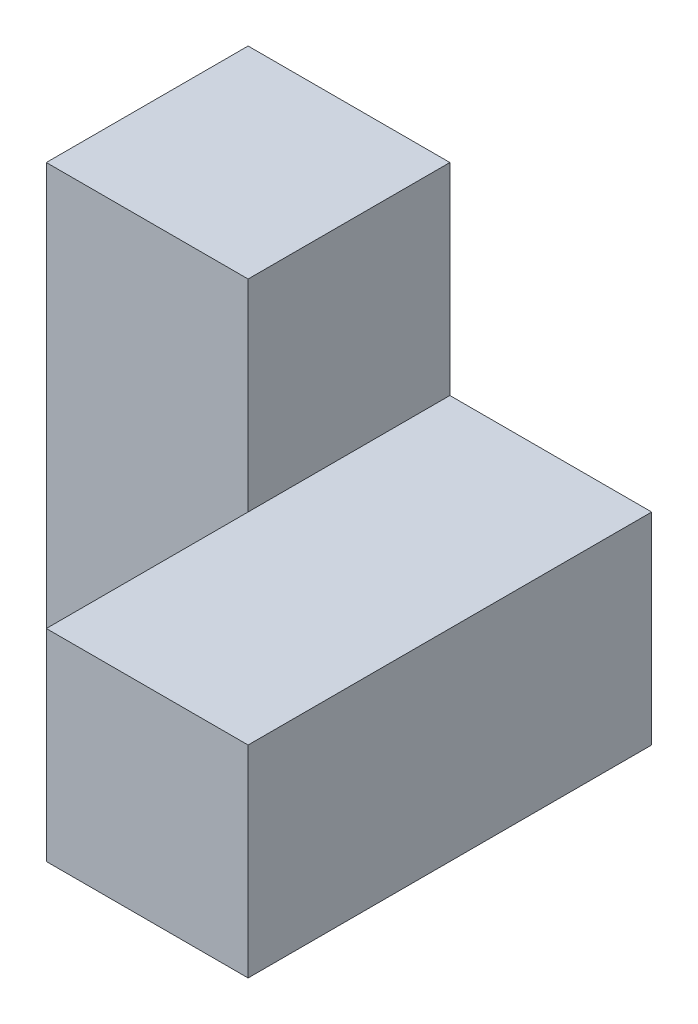
ISO-10303-21;
HEADER;
FILE_DESCRIPTION(('STEP AP214'),'2;1');
FILE_NAME('part.step','',(''),(''),'','','');
FILE_SCHEMA(('AUTOMOTIVE_DESIGN { 1 0 10303 214 1 1 1 1 }'));
ENDSEC;
DATA;
#1=APPLICATION_CONTEXT('core data for automotive mechanical design processes');
#2=APPLICATION_PROTOCOL_DEFINITION('international standard','automotive_design',2000,#1);
#3=PRODUCT_CONTEXT('',#1,'mechanical');
#4=PRODUCT('Part','Part','',(#3));
#5=PRODUCT_RELATED_PRODUCT_CATEGORY('part','',(#4));
#6=PRODUCT_DEFINITION_FORMATION('','',#4);
#7=PRODUCT_DEFINITION_CONTEXT('part definition',#1,'design');
#8=PRODUCT_DEFINITION('design','',#6,#7);
#9=PRODUCT_DEFINITION_SHAPE('','',#8);
#10=(LENGTH_UNIT() NAMED_UNIT(*) SI_UNIT(.MILLI.,.METRE.));
#11=(NAMED_UNIT(*) PLANE_ANGLE_UNIT() SI_UNIT($,.RADIAN.));
#12=(NAMED_UNIT(*) SI_UNIT($,.STERADIAN.) SOLID_ANGLE_UNIT());
#13=UNCERTAINTY_MEASURE_WITH_UNIT(LENGTH_MEASURE(1.E-05),#10,'distance_accuracy_value','');
#14=(GEOMETRIC_REPRESENTATION_CONTEXT(3) GLOBAL_UNCERTAINTY_ASSIGNED_CONTEXT((#13)) GLOBAL_UNIT_ASSIGNED_CONTEXT((#10,
#11,#12)) REPRESENTATION_CONTEXT('',''));
#15=CARTESIAN_POINT('',(0.,0.,0.));
#16=DIRECTION('',(0.,0.,1.));
#17=DIRECTION('',(1.,0.,0.));
#18=AXIS2_PLACEMENT_3D('',#15,#16,#17);
#19=CARTESIAN_POINT('',(25.4,25.4,25.4));
#20=DIRECTION('',(-1.,0.,0.));
#21=DIRECTION('',(0.,0.,1.));
#22=AXIS2_PLACEMENT_3D('',#19,#20,#21);
#23=PLANE('',#22);
#24=DIRECTION('',(0.,0.,-1.));
#25=VECTOR('',#24,1.);
#26=CARTESIAN_POINT('',(25.4,0.,25.4));
#27=LINE('',#26,#25);
#28=CARTESIAN_POINT('',(25.4,0.,25.4));
#29=VERTEX_POINT('',#28);
#30=CARTESIAN_POINT('',(25.4,0.,-25.4));
#31=VERTEX_POINT('',#30);
#32=EDGE_CURVE('E92',#29,#31,#27,.T.);
#33=ORIENTED_EDGE('',*,*,#32,.T.);
#34=DIRECTION('',(0.,-1.,0.));
#35=VECTOR('',#34,1.);
#36=CARTESIAN_POINT('',(25.4,25.4,-25.4));
#37=LINE('',#36,#35);
#38=CARTESIAN_POINT('',(25.4,25.4,-25.4));
#39=VERTEX_POINT('',#38);
#40=EDGE_CURVE('E11',#39,#31,#37,.T.);
#41=ORIENTED_EDGE('',*,*,#40,.F.);
#42=DIRECTION('',(0.,0.,-1.));
#43=VECTOR('',#42,1.);
#44=CARTESIAN_POINT('',(25.4,25.4,25.4));
#45=LINE('',#44,#43);
#46=CARTESIAN_POINT('',(25.4,25.4,25.4));
#47=VERTEX_POINT('',#46);
#48=EDGE_CURVE('E86',#47,#39,#45,.T.);
#49=ORIENTED_EDGE('',*,*,#48,.F.);
#50=DIRECTION('',(0.,-1.,0.));
#51=VECTOR('',#50,1.);
#52=CARTESIAN_POINT('',(25.4,25.4,25.4));
#53=LINE('',#52,#51);
#54=EDGE_CURVE('E78',#47,#29,#53,.T.);
#55=ORIENTED_EDGE('',*,*,#54,.T.);
#56=EDGE_LOOP('',(#33,#41,#49,#55));
#57=FACE_BOUND('',#56,.T.);
#58=ADVANCED_FACE('F33',(#57),#23,.F.);
#59=CARTESIAN_POINT('',(-25.4,25.4,-25.4));
#60=DIRECTION('',(0.,0.,1.));
#61=DIRECTION('',(1.,0.,0.));
#62=AXIS2_PLACEMENT_3D('',#59,#60,#61);
#63=PLANE('',#62);
#64=DIRECTION('',(-1.,0.,0.));
#65=VECTOR('',#64,1.);
#66=CARTESIAN_POINT('',(-25.4,0.,-25.4));
#67=LINE('',#66,#65);
#68=CARTESIAN_POINT('',(-25.4,0.,-25.4));
#69=VERTEX_POINT('',#68);
#70=EDGE_CURVE('E96',#31,#69,#67,.T.);
#71=ORIENTED_EDGE('',*,*,#70,.T.);
#72=DIRECTION('',(0.,-1.,0.));
#73=VECTOR('',#72,1.);
#74=CARTESIAN_POINT('',(-25.4,25.4,-25.4));
#75=LINE('',#74,#73);
#76=CARTESIAN_POINT('',(-25.4,50.8,-25.4));
#77=VERTEX_POINT('',#76);
#78=EDGE_CURVE('E41',#77,#69,#75,.T.);
#79=ORIENTED_EDGE('',*,*,#78,.F.);
#80=DIRECTION('',(-1.,0.,0.));
#81=VECTOR('',#80,1.);
#82=CARTESIAN_POINT('',(0.,50.8,-25.4));
#83=LINE('',#82,#81);
#84=CARTESIAN_POINT('',(0.,50.8,-25.4));
#85=VERTEX_POINT('',#84);
#86=EDGE_CURVE('E135',#85,#77,#83,.T.);
#87=ORIENTED_EDGE('',*,*,#86,.F.);
#88=DIRECTION('',(0.,-1.,0.));
#89=VECTOR('',#88,1.);
#90=CARTESIAN_POINT('',(0.,50.8,-25.4));
#91=LINE('',#90,#89);
#92=CARTESIAN_POINT('',(0.,25.4,-25.4));
#93=VERTEX_POINT('',#92);
#94=EDGE_CURVE('E113',#85,#93,#91,.T.);
#95=ORIENTED_EDGE('',*,*,#94,.T.);
#96=DIRECTION('',(-1.,0.,0.));
#97=VECTOR('',#96,1.);
#98=CARTESIAN_POINT('',(-25.4,25.4,-25.4));
#99=LINE('',#98,#97);
#100=EDGE_CURVE('E110',#39,#93,#99,.T.);
#101=ORIENTED_EDGE('',*,*,#100,.F.);
#102=ORIENTED_EDGE('',*,*,#40,.T.);
#103=EDGE_LOOP('',(#71,#79,#87,#95,#101,#102));
#104=FACE_BOUND('',#103,.T.);
#105=ADVANCED_FACE('F174',(#104),#63,.F.);
#106=CARTESIAN_POINT('',(-25.4,25.4,25.4));
#107=DIRECTION('',(1.,0.,0.));
#108=DIRECTION('',(0.,0.,-1.));
#109=AXIS2_PLACEMENT_3D('',#106,#107,#108);
#110=PLANE('',#109);
#111=DIRECTION('',(0.,0.,1.));
#112=VECTOR('',#111,1.);
#113=CARTESIAN_POINT('',(-25.4,0.,25.4));
#114=LINE('',#113,#112);
#115=CARTESIAN_POINT('',(-25.4,0.,0.));
#116=VERTEX_POINT('',#115);
#117=EDGE_CURVE('E87',#69,#116,#114,.T.);
#118=ORIENTED_EDGE('',*,*,#117,.T.);
#119=DIRECTION('',(0.,1.,0.));
#120=VECTOR('',#119,1.);
#121=CARTESIAN_POINT('',(-25.4,0.,0.));
#122=LINE('',#121,#120);
#123=CARTESIAN_POINT('',(-25.4,50.8,0.));
#124=VERTEX_POINT('',#123);
#125=EDGE_CURVE('E97',#116,#124,#122,.T.);
#126=ORIENTED_EDGE('',*,*,#125,.T.);
#127=DIRECTION('',(0.,0.,1.));
#128=VECTOR('',#127,1.);
#129=CARTESIAN_POINT('',(-25.4,50.8,0.));
#130=LINE('',#129,#128);
#131=EDGE_CURVE('E132',#77,#124,#130,.T.);
#132=ORIENTED_EDGE('',*,*,#131,.F.);
#133=ORIENTED_EDGE('',*,*,#78,.T.);
#134=EDGE_LOOP('',(#118,#126,#132,#133));
#135=FACE_BOUND('',#134,.T.);
#136=ADVANCED_FACE('F179',(#135),#110,.F.);
#137=CARTESIAN_POINT('',(-25.4,25.4,25.4));
#138=DIRECTION('',(0.,0.,-1.));
#139=DIRECTION('',(-1.,0.,0.));
#140=AXIS2_PLACEMENT_3D('',#137,#138,#139);
#141=PLANE('',#140);
#142=DIRECTION('',(1.,0.,0.));
#143=VECTOR('',#142,1.);
#144=CARTESIAN_POINT('',(-25.4,25.4,25.4));
#145=LINE('',#144,#143);
#146=CARTESIAN_POINT('',(0.,25.4,25.4));
#147=VERTEX_POINT('',#146);
#148=EDGE_CURVE('E58',#147,#47,#145,.T.);
#149=ORIENTED_EDGE('',*,*,#148,.F.);
#150=DIRECTION('',(0.,1.,0.));
#151=VECTOR('',#150,1.);
#152=CARTESIAN_POINT('',(0.,0.,25.4));
#153=LINE('',#152,#151);
#154=CARTESIAN_POINT('',(0.,0.,25.4));
#155=VERTEX_POINT('',#154);
#156=EDGE_CURVE('E82',#155,#147,#153,.T.);
#157=ORIENTED_EDGE('',*,*,#156,.F.);
#158=DIRECTION('',(1.,0.,0.));
#159=VECTOR('',#158,1.);
#160=CARTESIAN_POINT('',(-25.4,0.,25.4));
#161=LINE('',#160,#159);
#162=EDGE_CURVE('E75',#155,#29,#161,.T.);
#163=ORIENTED_EDGE('',*,*,#162,.T.);
#164=ORIENTED_EDGE('',*,*,#54,.F.);
#165=EDGE_LOOP('',(#149,#157,#163,#164));
#166=FACE_BOUND('',#165,.T.);
#167=ADVANCED_FACE('F77',(#166),#141,.F.);
#168=CARTESIAN_POINT('',(0.,25.4,0.));
#169=DIRECTION('',(0.,-1.,0.));
#170=DIRECTION('',(0.,0.,-1.));
#171=AXIS2_PLACEMENT_3D('',#168,#169,#170);
#172=PLANE('',#171);
#173=ORIENTED_EDGE('',*,*,#100,.T.);
#174=DIRECTION('',(0.,0.,1.));
#175=VECTOR('',#174,1.);
#176=CARTESIAN_POINT('',(0.,25.4,0.));
#177=LINE('',#176,#175);
#178=CARTESIAN_POINT('',(0.,25.4,0.));
#179=VERTEX_POINT('',#178);
#180=EDGE_CURVE('E140',#93,#179,#177,.T.);
#181=ORIENTED_EDGE('',*,*,#180,.T.);
#182=DIRECTION('',(0.,0.,-1.));
#183=VECTOR('',#182,1.);
#184=CARTESIAN_POINT('',(0.,25.4,25.4));
#185=LINE('',#184,#183);
#186=EDGE_CURVE('E120',#147,#179,#185,.T.);
#187=ORIENTED_EDGE('',*,*,#186,.F.);
#188=ORIENTED_EDGE('',*,*,#148,.T.);
#189=ORIENTED_EDGE('',*,*,#48,.T.);
#190=EDGE_LOOP('',(#173,#181,#187,#188,#189));
#191=FACE_BOUND('',#190,.T.);
#192=ADVANCED_FACE('F149',(#191),#172,.F.);
#193=CARTESIAN_POINT('',(0.,0.,0.));
#194=DIRECTION('',(0.,-1.,0.));
#195=DIRECTION('',(0.,0.,-1.));
#196=AXIS2_PLACEMENT_3D('',#193,#194,#195);
#197=PLANE('',#196);
#198=DIRECTION('',(-1.,0.,0.));
#199=VECTOR('',#198,1.);
#200=CARTESIAN_POINT('',(-25.4,0.,0.));
#201=LINE('',#200,#199);
#202=CARTESIAN_POINT('',(0.,0.,0.));
#203=VERTEX_POINT('',#202);
#204=EDGE_CURVE('E49',#203,#116,#201,.T.);
#205=ORIENTED_EDGE('',*,*,#204,.T.);
#206=ORIENTED_EDGE('',*,*,#117,.F.);
#207=ORIENTED_EDGE('',*,*,#70,.F.);
#208=ORIENTED_EDGE('',*,*,#32,.F.);
#209=ORIENTED_EDGE('',*,*,#162,.F.);
#210=DIRECTION('',(0.,0.,-1.));
#211=VECTOR('',#210,1.);
#212=CARTESIAN_POINT('',(0.,0.,25.4));
#213=LINE('',#212,#211);
#214=EDGE_CURVE('E123',#155,#203,#213,.T.);
#215=ORIENTED_EDGE('',*,*,#214,.T.);
#216=EDGE_LOOP('',(#205,#206,#207,#208,#209,#215));
#217=FACE_BOUND('',#216,.T.);
#218=ADVANCED_FACE('F94',(#217),#197,.T.);
#219=CARTESIAN_POINT('',(-25.4,0.,0.));
#220=DIRECTION('',(0.,0.,-1.));
#221=DIRECTION('',(-1.,0.,0.));
#222=AXIS2_PLACEMENT_3D('',#219,#220,#221);
#223=PLANE('',#222);
#224=DIRECTION('',(0.,1.,0.));
#225=VECTOR('',#224,1.);
#226=CARTESIAN_POINT('',(0.,0.,0.));
#227=LINE('',#226,#225);
#228=EDGE_CURVE('E101',#203,#179,#227,.T.);
#229=ORIENTED_EDGE('',*,*,#228,.T.);
#230=DIRECTION('',(0.,-1.,0.));
#231=VECTOR('',#230,1.);
#232=CARTESIAN_POINT('',(0.,50.8,0.));
#233=LINE('',#232,#231);
#234=CARTESIAN_POINT('',(0.,50.8,0.));
#235=VERTEX_POINT('',#234);
#236=EDGE_CURVE('E126',#235,#179,#233,.T.);
#237=ORIENTED_EDGE('',*,*,#236,.F.);
#238=DIRECTION('',(1.,0.,0.));
#239=VECTOR('',#238,1.);
#240=CARTESIAN_POINT('',(0.,50.8,0.));
#241=LINE('',#240,#239);
#242=EDGE_CURVE('E129',#124,#235,#241,.T.);
#243=ORIENTED_EDGE('',*,*,#242,.F.);
#244=ORIENTED_EDGE('',*,*,#125,.F.);
#245=ORIENTED_EDGE('',*,*,#204,.F.);
#246=EDGE_LOOP('',(#229,#237,#243,#244,#245));
#247=FACE_BOUND('',#246,.T.);
#248=ADVANCED_FACE('F153',(#247),#223,.F.);
#249=CARTESIAN_POINT('',(0.,0.,25.4));
#250=DIRECTION('',(1.,0.,0.));
#251=DIRECTION('',(0.,0.,-1.));
#252=AXIS2_PLACEMENT_3D('',#249,#250,#251);
#253=PLANE('',#252);
#254=ORIENTED_EDGE('',*,*,#186,.T.);
#255=ORIENTED_EDGE('',*,*,#228,.F.);
#256=ORIENTED_EDGE('',*,*,#214,.F.);
#257=ORIENTED_EDGE('',*,*,#156,.T.);
#258=EDGE_LOOP('',(#254,#255,#256,#257));
#259=FACE_BOUND('',#258,.T.);
#260=ADVANCED_FACE('F157',(#259),#253,.F.);
#261=CARTESIAN_POINT('',(0.,50.8,0.));
#262=DIRECTION('',(1.,0.,0.));
#263=DIRECTION('',(0.,0.,-1.));
#264=AXIS2_PLACEMENT_3D('',#261,#262,#263);
#265=PLANE('',#264);
#266=ORIENTED_EDGE('',*,*,#180,.F.);
#267=ORIENTED_EDGE('',*,*,#94,.F.);
#268=DIRECTION('',(0.,0.,1.));
#269=VECTOR('',#268,1.);
#270=CARTESIAN_POINT('',(0.,50.8,0.));
#271=LINE('',#270,#269);
#272=EDGE_CURVE('E138',#85,#235,#271,.T.);
#273=ORIENTED_EDGE('',*,*,#272,.T.);
#274=ORIENTED_EDGE('',*,*,#236,.T.);
#275=EDGE_LOOP('',(#266,#267,#273,#274));
#276=FACE_BOUND('',#275,.T.);
#277=ADVANCED_FACE('F172',(#276),#265,.T.);
#278=CARTESIAN_POINT('',(0.,50.8,0.));
#279=DIRECTION('',(0.,1.,0.));
#280=DIRECTION('',(0.,0.,1.));
#281=AXIS2_PLACEMENT_3D('',#278,#279,#280);
#282=PLANE('',#281);
#283=ORIENTED_EDGE('',*,*,#272,.F.);
#284=ORIENTED_EDGE('',*,*,#86,.T.);
#285=ORIENTED_EDGE('',*,*,#131,.T.);
#286=ORIENTED_EDGE('',*,*,#242,.T.);
#287=EDGE_LOOP('',(#283,#284,#285,#286));
#288=FACE_BOUND('',#287,.T.);
#289=ADVANCED_FACE('F177',(#288),#282,.T.);
#290=CLOSED_SHELL('',(#58,#105,#136,#167,#192,#218,#248,#260,#277,#289));
#291=MANIFOLD_SOLID_BREP('B2',#290);
#292=ADVANCED_BREP_SHAPE_REPRESENTATION('',(#18,#291),#14);
#293=SHAPE_DEFINITION_REPRESENTATION(#9,#292);
ENDSEC;
END-ISO-10303-21;
